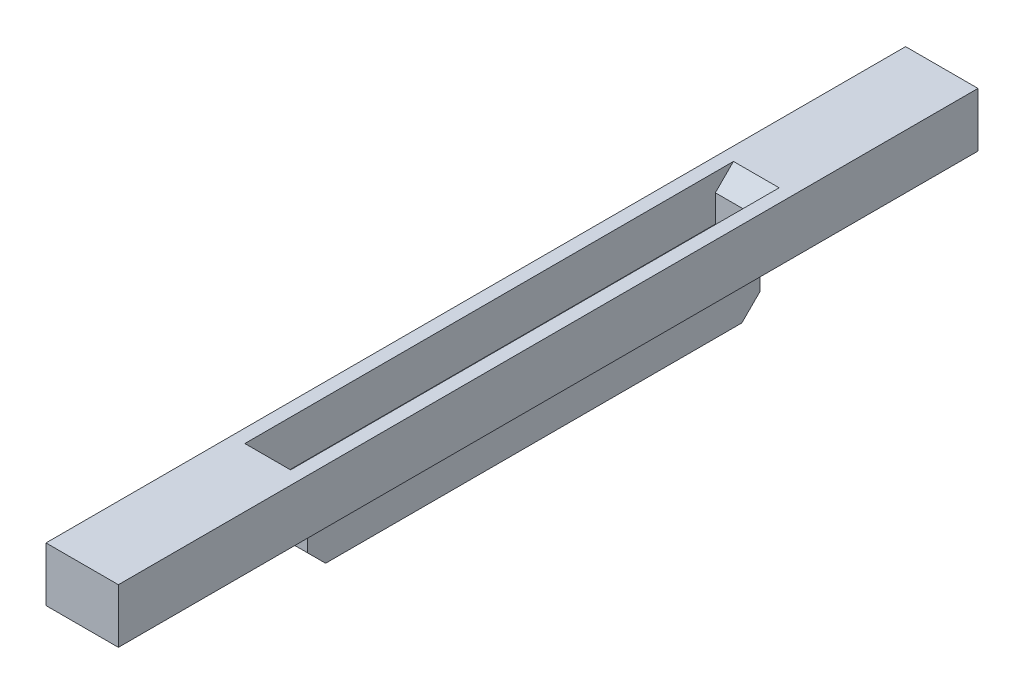
ISO-10303-21;
HEADER;
FILE_DESCRIPTION(('STEP AP214'),'2;1');
FILE_NAME('part.step','',(''),(''),'','','');
FILE_SCHEMA(('AUTOMOTIVE_DESIGN { 1 0 10303 214 1 1 1 1 }'));
ENDSEC;
DATA;
#1=APPLICATION_CONTEXT('core data for automotive mechanical design processes');
#2=APPLICATION_PROTOCOL_DEFINITION('international standard','automotive_design',2000,#1);
#3=PRODUCT_CONTEXT('',#1,'mechanical');
#4=PRODUCT('Part','Part','',(#3));
#5=PRODUCT_RELATED_PRODUCT_CATEGORY('part','',(#4));
#6=PRODUCT_DEFINITION_FORMATION('','',#4);
#7=PRODUCT_DEFINITION_CONTEXT('part definition',#1,'design');
#8=PRODUCT_DEFINITION('design','',#6,#7);
#9=PRODUCT_DEFINITION_SHAPE('','',#8);
#10=(LENGTH_UNIT() NAMED_UNIT(*) SI_UNIT(.MILLI.,.METRE.));
#11=(NAMED_UNIT(*) PLANE_ANGLE_UNIT() SI_UNIT($,.RADIAN.));
#12=(NAMED_UNIT(*) SI_UNIT($,.STERADIAN.) SOLID_ANGLE_UNIT());
#13=UNCERTAINTY_MEASURE_WITH_UNIT(LENGTH_MEASURE(1.E-05),#10,'distance_accuracy_value','');
#14=(GEOMETRIC_REPRESENTATION_CONTEXT(3) GLOBAL_UNCERTAINTY_ASSIGNED_CONTEXT((#13)) GLOBAL_UNIT_ASSIGNED_CONTEXT((#10,
#11,#12)) REPRESENTATION_CONTEXT('',''));
#15=CARTESIAN_POINT('',(0.,0.,0.));
#16=DIRECTION('',(0.,0.,1.));
#17=DIRECTION('',(1.,0.,0.));
#18=AXIS2_PLACEMENT_3D('',#15,#16,#17);
#19=CARTESIAN_POINT('',(0.,-1.,0.));
#20=DIRECTION('',(0.,1.,0.));
#21=DIRECTION('',(0.,0.,1.));
#22=AXIS2_PLACEMENT_3D('',#19,#20,#21);
#23=PLANE('',#22);
#24=DIRECTION('',(0.,0.,1.));
#25=VECTOR('',#24,1.);
#26=CARTESIAN_POINT('',(4.,-1.,0.));
#27=LINE('',#26,#25);
#28=CARTESIAN_POINT('',(4.,-1.,-47.5));
#29=VERTEX_POINT('',#28);
#30=CARTESIAN_POINT('',(4.00000000000001,-1.,47.5));
#31=VERTEX_POINT('',#30);
#32=EDGE_CURVE('E186',#29,#31,#27,.T.);
#33=ORIENTED_EDGE('',*,*,#32,.T.);
#34=DIRECTION('',(1.,0.,0.));
#35=VECTOR('',#34,1.);
#36=CARTESIAN_POINT('',(0.,-1.,47.5));
#37=LINE('',#36,#35);
#38=CARTESIAN_POINT('',(-3.99999999999999,-1.,47.5));
#39=VERTEX_POINT('',#38);
#40=EDGE_CURVE('E195',#39,#31,#37,.T.);
#41=ORIENTED_EDGE('',*,*,#40,.F.);
#42=DIRECTION('',(0.,0.,1.));
#43=VECTOR('',#42,1.);
#44=CARTESIAN_POINT('',(-4.,-1.,0.));
#45=LINE('',#44,#43);
#46=CARTESIAN_POINT('',(-4.,-1.,-47.5));
#47=VERTEX_POINT('',#46);
#48=EDGE_CURVE('E192',#47,#39,#45,.T.);
#49=ORIENTED_EDGE('',*,*,#48,.F.);
#50=DIRECTION('',(1.,0.,0.));
#51=VECTOR('',#50,1.);
#52=CARTESIAN_POINT('',(0.,-1.,-47.5));
#53=LINE('',#52,#51);
#54=EDGE_CURVE('E189',#47,#29,#53,.T.);
#55=ORIENTED_EDGE('',*,*,#54,.T.);
#56=EDGE_LOOP('',(#33,#41,#49,#55));
#57=FACE_BOUND('',#56,.T.);
#58=DIRECTION('',(0.,0.,-1.));
#59=VECTOR('',#58,1.);
#60=CARTESIAN_POINT('',(-2.4,-1.,25.));
#61=LINE('',#60,#59);
#62=CARTESIAN_POINT('',(-2.4,-1.,25.));
#63=VERTEX_POINT('',#62);
#64=CARTESIAN_POINT('',(-2.4,-1.,-25.));
#65=VERTEX_POINT('',#64);
#66=EDGE_CURVE('E153',#63,#65,#61,.T.);
#67=ORIENTED_EDGE('',*,*,#66,.F.);
#68=DIRECTION('',(-1.,0.,0.));
#69=VECTOR('',#68,1.);
#70=CARTESIAN_POINT('',(2.4,-1.,25.));
#71=LINE('',#70,#69);
#72=CARTESIAN_POINT('',(2.4,-1.,25.));
#73=VERTEX_POINT('',#72);
#74=EDGE_CURVE('E166',#73,#63,#71,.T.);
#75=ORIENTED_EDGE('',*,*,#74,.F.);
#76=DIRECTION('',(0.,0.,1.));
#77=VECTOR('',#76,1.);
#78=CARTESIAN_POINT('',(2.4,-1.,25.));
#79=LINE('',#78,#77);
#80=CARTESIAN_POINT('',(2.4,-1.,-25.));
#81=VERTEX_POINT('',#80);
#82=EDGE_CURVE('E174',#81,#73,#79,.T.);
#83=ORIENTED_EDGE('',*,*,#82,.F.);
#84=DIRECTION('',(1.,0.,0.));
#85=VECTOR('',#84,1.);
#86=CARTESIAN_POINT('',(2.4,-1.,-25.));
#87=LINE('',#86,#85);
#88=EDGE_CURVE('E169',#65,#81,#87,.T.);
#89=ORIENTED_EDGE('',*,*,#88,.F.);
#90=EDGE_LOOP('',(#67,#75,#83,#89));
#91=FACE_BOUND('',#90,.T.);
#92=ADVANCED_FACE('F37',(#57,#91),#23,.F.);
#93=CARTESIAN_POINT('',(0.,5.,0.));
#94=DIRECTION('',(0.,1.,0.));
#95=DIRECTION('',(0.,0.,1.));
#96=AXIS2_PLACEMENT_3D('',#93,#94,#95);
#97=PLANE('',#96);
#98=DIRECTION('',(0.,0.,-1.));
#99=VECTOR('',#98,1.);
#100=CARTESIAN_POINT('',(4.,5.,-47.5));
#101=LINE('',#100,#99);
#102=CARTESIAN_POINT('',(4.00000000000001,5.,47.5));
#103=VERTEX_POINT('',#102);
#104=CARTESIAN_POINT('',(4.,5.,-47.5));
#105=VERTEX_POINT('',#104);
#106=EDGE_CURVE('E222',#103,#105,#101,.T.);
#107=ORIENTED_EDGE('',*,*,#106,.T.);
#108=DIRECTION('',(-1.,0.,0.));
#109=VECTOR('',#108,1.);
#110=CARTESIAN_POINT('',(-4.,5.,-47.5));
#111=LINE('',#110,#109);
#112=CARTESIAN_POINT('',(-4.,5.,-47.5));
#113=VERTEX_POINT('',#112);
#114=EDGE_CURVE('E225',#105,#113,#111,.T.);
#115=ORIENTED_EDGE('',*,*,#114,.T.);
#116=DIRECTION('',(0.,0.,1.));
#117=VECTOR('',#116,1.);
#118=CARTESIAN_POINT('',(-4.,5.,-47.5));
#119=LINE('',#118,#117);
#120=CARTESIAN_POINT('',(-3.99999999999999,5.,47.5));
#121=VERTEX_POINT('',#120);
#122=EDGE_CURVE('E227',#113,#121,#119,.T.);
#123=ORIENTED_EDGE('',*,*,#122,.T.);
#124=DIRECTION('',(1.,0.,0.));
#125=VECTOR('',#124,1.);
#126=CARTESIAN_POINT('',(-3.99999999999999,5.,47.5));
#127=LINE('',#126,#125);
#128=EDGE_CURVE('E229',#121,#103,#127,.T.);
#129=ORIENTED_EDGE('',*,*,#128,.T.);
#130=EDGE_LOOP('',(#107,#115,#123,#129));
#131=FACE_BOUND('',#130,.T.);
#132=DIRECTION('',(0.,0.,1.));
#133=VECTOR('',#132,1.);
#134=CARTESIAN_POINT('',(-2.525,5.,-25.));
#135=LINE('',#134,#133);
#136=CARTESIAN_POINT('',(-2.525,5.,-27.));
#137=VERTEX_POINT('',#136);
#138=CARTESIAN_POINT('',(-2.525,5.,27.));
#139=VERTEX_POINT('',#138);
#140=EDGE_CURVE('E201',#137,#139,#135,.T.);
#141=ORIENTED_EDGE('',*,*,#140,.F.);
#142=DIRECTION('',(1.,0.,0.));
#143=VECTOR('',#142,1.);
#144=CARTESIAN_POINT('',(0.,5.,-27.));
#145=LINE('',#144,#143);
#146=CARTESIAN_POINT('',(2.525,5.,-27.));
#147=VERTEX_POINT('',#146);
#148=EDGE_CURVE('E262',#137,#147,#145,.T.);
#149=ORIENTED_EDGE('',*,*,#148,.T.);
#150=DIRECTION('',(0.,0.,-1.));
#151=VECTOR('',#150,1.);
#152=CARTESIAN_POINT('',(2.525,5.,-25.));
#153=LINE('',#152,#151);
#154=CARTESIAN_POINT('',(2.525,5.,27.));
#155=VERTEX_POINT('',#154);
#156=EDGE_CURVE('E199',#155,#147,#153,.T.);
#157=ORIENTED_EDGE('',*,*,#156,.F.);
#158=DIRECTION('',(-1.,0.,0.));
#159=VECTOR('',#158,1.);
#160=CARTESIAN_POINT('',(0.,5.,27.));
#161=LINE('',#160,#159);
#162=EDGE_CURVE('E259',#155,#139,#161,.T.);
#163=ORIENTED_EDGE('',*,*,#162,.T.);
#164=EDGE_LOOP('',(#141,#149,#157,#163));
#165=FACE_BOUND('',#164,.T.);
#166=ADVANCED_FACE('F276',(#131,#165),#97,.T.);
#167=CARTESIAN_POINT('',(4.,5.,-47.5));
#168=DIRECTION('',(-1.,0.,0.));
#169=DIRECTION('',(0.,0.,1.));
#170=AXIS2_PLACEMENT_3D('',#167,#168,#169);
#171=PLANE('',#170);
#172=DIRECTION('',(0.,-1.,0.));
#173=VECTOR('',#172,1.);
#174=CARTESIAN_POINT('',(4.00000000000001,5.,47.5));
#175=LINE('',#174,#173);
#176=EDGE_CURVE('E231',#103,#31,#175,.T.);
#177=ORIENTED_EDGE('',*,*,#176,.T.);
#178=ORIENTED_EDGE('',*,*,#32,.F.);
#179=DIRECTION('',(0.,-1.,0.));
#180=VECTOR('',#179,1.);
#181=CARTESIAN_POINT('',(4.,5.,-47.5));
#182=LINE('',#181,#180);
#183=EDGE_CURVE('E237',#105,#29,#182,.T.);
#184=ORIENTED_EDGE('',*,*,#183,.F.);
#185=ORIENTED_EDGE('',*,*,#106,.F.);
#186=EDGE_LOOP('',(#177,#178,#184,#185));
#187=FACE_BOUND('',#186,.T.);
#188=ADVANCED_FACE('F308',(#187),#171,.F.);
#189=CARTESIAN_POINT('',(-4.,5.,-47.5));
#190=DIRECTION('',(0.,0.,1.));
#191=DIRECTION('',(1.,0.,0.));
#192=AXIS2_PLACEMENT_3D('',#189,#190,#191);
#193=PLANE('',#192);
#194=ORIENTED_EDGE('',*,*,#183,.T.);
#195=ORIENTED_EDGE('',*,*,#54,.F.);
#196=DIRECTION('',(0.,-1.,0.));
#197=VECTOR('',#196,1.);
#198=CARTESIAN_POINT('',(-4.,5.,-47.5));
#199=LINE('',#198,#197);
#200=EDGE_CURVE('E235',#113,#47,#199,.T.);
#201=ORIENTED_EDGE('',*,*,#200,.F.);
#202=ORIENTED_EDGE('',*,*,#114,.F.);
#203=EDGE_LOOP('',(#194,#195,#201,#202));
#204=FACE_BOUND('',#203,.T.);
#205=ADVANCED_FACE('F360',(#204),#193,.F.);
#206=CARTESIAN_POINT('',(-4.,5.,-47.5));
#207=DIRECTION('',(1.,0.,0.));
#208=DIRECTION('',(0.,0.,-1.));
#209=AXIS2_PLACEMENT_3D('',#206,#207,#208);
#210=PLANE('',#209);
#211=ORIENTED_EDGE('',*,*,#200,.T.);
#212=ORIENTED_EDGE('',*,*,#48,.T.);
#213=DIRECTION('',(0.,-1.,0.));
#214=VECTOR('',#213,1.);
#215=CARTESIAN_POINT('',(-3.99999999999999,5.,47.5));
#216=LINE('',#215,#214);
#217=EDGE_CURVE('E233',#121,#39,#216,.T.);
#218=ORIENTED_EDGE('',*,*,#217,.F.);
#219=ORIENTED_EDGE('',*,*,#122,.F.);
#220=EDGE_LOOP('',(#211,#212,#218,#219));
#221=FACE_BOUND('',#220,.T.);
#222=ADVANCED_FACE('F364',(#221),#210,.F.);
#223=CARTESIAN_POINT('',(-3.99999999999999,5.,47.5));
#224=DIRECTION('',(0.,0.,-1.));
#225=DIRECTION('',(-1.,0.,0.));
#226=AXIS2_PLACEMENT_3D('',#223,#224,#225);
#227=PLANE('',#226);
#228=ORIENTED_EDGE('',*,*,#217,.T.);
#229=ORIENTED_EDGE('',*,*,#40,.T.);
#230=ORIENTED_EDGE('',*,*,#176,.F.);
#231=ORIENTED_EDGE('',*,*,#128,.F.);
#232=EDGE_LOOP('',(#228,#229,#230,#231));
#233=FACE_BOUND('',#232,.T.);
#234=ADVANCED_FACE('F368',(#233),#227,.F.);
#235=CARTESIAN_POINT('',(2.525,5.,-25.));
#236=DIRECTION('',(-1.,0.,0.));
#237=DIRECTION('',(0.,0.,1.));
#238=AXIS2_PLACEMENT_3D('',#235,#236,#237);
#239=PLANE('',#238);
#240=DIRECTION('',(0.,0.,-1.));
#241=VECTOR('',#240,1.);
#242=CARTESIAN_POINT('',(2.525,0.,-25.));
#243=LINE('',#242,#241);
#244=CARTESIAN_POINT('',(2.52500000000001,0.,25.));
#245=VERTEX_POINT('',#244);
#246=CARTESIAN_POINT('',(2.525,0.,-25.));
#247=VERTEX_POINT('',#246);
#248=EDGE_CURVE('E198',#245,#247,#243,.T.);
#249=ORIENTED_EDGE('',*,*,#248,.F.);
#250=DIRECTION('',(0.,-1.,0.));
#251=VECTOR('',#250,1.);
#252=CARTESIAN_POINT('',(2.525,5.,25.));
#253=LINE('',#252,#251);
#254=CARTESIAN_POINT('',(2.525,2.99999999999997,25.));
#255=VERTEX_POINT('',#254);
#256=EDGE_CURVE('E204',#255,#245,#253,.T.);
#257=ORIENTED_EDGE('',*,*,#256,.F.);
#258=DIRECTION('',(0.,-0.707106781186548,-0.707106781186548));
#259=VECTOR('',#258,1.);
#260=CARTESIAN_POINT('',(2.525,2.99999999999997,25.));
#261=LINE('',#260,#259);
#262=EDGE_CURVE('E45',#255,#155,#261,.F.);
#263=ORIENTED_EDGE('',*,*,#262,.T.);
#264=ORIENTED_EDGE('',*,*,#156,.T.);
#265=DIRECTION('',(0.,0.707106781186548,-0.707106781186548));
#266=VECTOR('',#265,1.);
#267=CARTESIAN_POINT('',(2.525,2.99999999999997,-25.));
#268=LINE('',#267,#266);
#269=CARTESIAN_POINT('',(2.525,2.99999999999997,-25.));
#270=VERTEX_POINT('',#269);
#271=EDGE_CURVE('E270',#147,#270,#268,.F.);
#272=ORIENTED_EDGE('',*,*,#271,.T.);
#273=DIRECTION('',(0.,-1.,0.));
#274=VECTOR('',#273,1.);
#275=CARTESIAN_POINT('',(2.525,5.,-25.));
#276=LINE('',#275,#274);
#277=EDGE_CURVE('E220',#270,#247,#276,.T.);
#278=ORIENTED_EDGE('',*,*,#277,.T.);
#279=EDGE_LOOP('',(#249,#257,#263,#264,#272,#278));
#280=FACE_BOUND('',#279,.T.);
#281=ADVANCED_FACE('F274',(#280),#239,.T.);
#282=CARTESIAN_POINT('',(-2.525,5.,-25.));
#283=DIRECTION('',(0.,0.,1.));
#284=DIRECTION('',(1.,0.,0.));
#285=AXIS2_PLACEMENT_3D('',#282,#283,#284);
#286=PLANE('',#285);
#287=ORIENTED_EDGE('',*,*,#277,.F.);
#288=DIRECTION('',(-1.,0.,0.));
#289=VECTOR('',#288,1.);
#290=CARTESIAN_POINT('',(-2.525,2.99999999999997,-25.));
#291=LINE('',#290,#289);
#292=CARTESIAN_POINT('',(-2.525,2.99999999999997,-25.));
#293=VERTEX_POINT('',#292);
#294=EDGE_CURVE('E256',#270,#293,#291,.T.);
#295=ORIENTED_EDGE('',*,*,#294,.T.);
#296=DIRECTION('',(0.,-1.,0.));
#297=VECTOR('',#296,1.);
#298=CARTESIAN_POINT('',(-2.525,5.,-25.));
#299=LINE('',#298,#297);
#300=CARTESIAN_POINT('',(-2.525,0.,-25.));
#301=VERTEX_POINT('',#300);
#302=EDGE_CURVE('E218',#293,#301,#299,.T.);
#303=ORIENTED_EDGE('',*,*,#302,.T.);
#304=DIRECTION('',(-1.,0.,0.));
#305=VECTOR('',#304,1.);
#306=CARTESIAN_POINT('',(-2.525,0.,-25.));
#307=LINE('',#306,#305);
#308=EDGE_CURVE('E207',#247,#301,#307,.T.);
#309=ORIENTED_EDGE('',*,*,#308,.F.);
#310=EDGE_LOOP('',(#287,#295,#303,#309));
#311=FACE_BOUND('',#310,.T.);
#312=ADVANCED_FACE('F285',(#311),#286,.T.);
#313=CARTESIAN_POINT('',(-2.525,5.,-25.));
#314=DIRECTION('',(1.,0.,0.));
#315=DIRECTION('',(0.,0.,-1.));
#316=AXIS2_PLACEMENT_3D('',#313,#314,#315);
#317=PLANE('',#316);
#318=DIRECTION('',(0.,0.,1.));
#319=VECTOR('',#318,1.);
#320=CARTESIAN_POINT('',(-2.525,0.,-25.));
#321=LINE('',#320,#319);
#322=CARTESIAN_POINT('',(-2.525,0.,25.));
#323=VERTEX_POINT('',#322);
#324=EDGE_CURVE('E210',#301,#323,#321,.T.);
#325=ORIENTED_EDGE('',*,*,#324,.F.);
#326=ORIENTED_EDGE('',*,*,#302,.F.);
#327=DIRECTION('',(0.,-0.707106781186548,0.707106781186548));
#328=VECTOR('',#327,1.);
#329=CARTESIAN_POINT('',(-2.525,2.99999999999997,-25.));
#330=LINE('',#329,#328);
#331=EDGE_CURVE('E267',#293,#137,#330,.F.);
#332=ORIENTED_EDGE('',*,*,#331,.T.);
#333=ORIENTED_EDGE('',*,*,#140,.T.);
#334=DIRECTION('',(0.,0.707106781186548,0.707106781186548));
#335=VECTOR('',#334,1.);
#336=CARTESIAN_POINT('',(-2.525,2.99999999999997,25.));
#337=LINE('',#336,#335);
#338=CARTESIAN_POINT('',(-2.525,2.99999999999997,25.));
#339=VERTEX_POINT('',#338);
#340=EDGE_CURVE('E11',#139,#339,#337,.F.);
#341=ORIENTED_EDGE('',*,*,#340,.T.);
#342=DIRECTION('',(0.,-1.,0.));
#343=VECTOR('',#342,1.);
#344=CARTESIAN_POINT('',(-2.525,5.,25.));
#345=LINE('',#344,#343);
#346=EDGE_CURVE('E216',#339,#323,#345,.T.);
#347=ORIENTED_EDGE('',*,*,#346,.T.);
#348=EDGE_LOOP('',(#325,#326,#332,#333,#341,#347));
#349=FACE_BOUND('',#348,.T.);
#350=ADVANCED_FACE('F293',(#349),#317,.T.);
#351=CARTESIAN_POINT('',(-2.525,5.,25.));
#352=DIRECTION('',(0.,0.,-1.));
#353=DIRECTION('',(-1.,0.,0.));
#354=AXIS2_PLACEMENT_3D('',#351,#352,#353);
#355=PLANE('',#354);
#356=ORIENTED_EDGE('',*,*,#346,.F.);
#357=DIRECTION('',(1.,0.,0.));
#358=VECTOR('',#357,1.);
#359=CARTESIAN_POINT('',(-2.525,2.99999999999997,25.));
#360=LINE('',#359,#358);
#361=EDGE_CURVE('E265',#339,#255,#360,.T.);
#362=ORIENTED_EDGE('',*,*,#361,.T.);
#363=ORIENTED_EDGE('',*,*,#256,.T.);
#364=DIRECTION('',(1.,0.,0.));
#365=VECTOR('',#364,1.);
#366=CARTESIAN_POINT('',(-2.525,0.,25.));
#367=LINE('',#366,#365);
#368=EDGE_CURVE('E202',#323,#245,#367,.T.);
#369=ORIENTED_EDGE('',*,*,#368,.F.);
#370=EDGE_LOOP('',(#356,#362,#363,#369));
#371=FACE_BOUND('',#370,.T.);
#372=ADVANCED_FACE('F292',(#371),#355,.T.);
#373=CARTESIAN_POINT('',(0.,0.,0.));
#374=DIRECTION('',(0.,1.,0.));
#375=DIRECTION('',(0.,0.,1.));
#376=AXIS2_PLACEMENT_3D('',#373,#374,#375);
#377=PLANE('',#376);
#378=ORIENTED_EDGE('',*,*,#368,.T.);
#379=ORIENTED_EDGE('',*,*,#248,.T.);
#380=ORIENTED_EDGE('',*,*,#308,.T.);
#381=ORIENTED_EDGE('',*,*,#324,.T.);
#382=EDGE_LOOP('',(#378,#379,#380,#381));
#383=FACE_BOUND('',#382,.T.);
#384=ADVANCED_FACE('F289',(#383),#377,.T.);
#385=CARTESIAN_POINT('',(-2.4,-6.,25.));
#386=DIRECTION('',(1.,0.,0.));
#387=DIRECTION('',(0.,0.,-1.));
#388=AXIS2_PLACEMENT_3D('',#385,#386,#387);
#389=PLANE('',#388);
#390=DIRECTION('',(0.,1.,0.));
#391=VECTOR('',#390,1.);
#392=CARTESIAN_POINT('',(-2.4,-6.,-25.));
#393=LINE('',#392,#391);
#394=CARTESIAN_POINT('',(-2.4,-4.,-25.));
#395=VERTEX_POINT('',#394);
#396=EDGE_CURVE('E184',#395,#65,#393,.T.);
#397=ORIENTED_EDGE('',*,*,#396,.F.);
#398=DIRECTION('',(0.,0.707106781186548,-0.707106781186548));
#399=VECTOR('',#398,1.);
#400=CARTESIAN_POINT('',(-2.4,-6.,-23.));
#401=LINE('',#400,#399);
#402=CARTESIAN_POINT('',(-2.4,-6.00000000000001,-23.));
#403=VERTEX_POINT('',#402);
#404=EDGE_CURVE('E252',#395,#403,#401,.F.);
#405=ORIENTED_EDGE('',*,*,#404,.T.);
#406=DIRECTION('',(0.,0.,-1.));
#407=VECTOR('',#406,1.);
#408=CARTESIAN_POINT('',(-2.4,-6.,25.));
#409=LINE('',#408,#407);
#410=CARTESIAN_POINT('',(-2.4,-6.,23.));
#411=VERTEX_POINT('',#410);
#412=EDGE_CURVE('E173',#411,#403,#409,.T.);
#413=ORIENTED_EDGE('',*,*,#412,.F.);
#414=DIRECTION('',(0.,-0.707106781186548,-0.707106781186548));
#415=VECTOR('',#414,1.);
#416=CARTESIAN_POINT('',(-2.4,-6.,23.));
#417=LINE('',#416,#415);
#418=CARTESIAN_POINT('',(-2.4,-4.,25.));
#419=VERTEX_POINT('',#418);
#420=EDGE_CURVE('E155',#411,#419,#417,.F.);
#421=ORIENTED_EDGE('',*,*,#420,.T.);
#422=DIRECTION('',(0.,1.,0.));
#423=VECTOR('',#422,1.);
#424=CARTESIAN_POINT('',(-2.4,-6.,25.));
#425=LINE('',#424,#423);
#426=EDGE_CURVE('E149',#419,#63,#425,.T.);
#427=ORIENTED_EDGE('',*,*,#426,.T.);
#428=ORIENTED_EDGE('',*,*,#66,.T.);
#429=EDGE_LOOP('',(#397,#405,#413,#421,#427,#428));
#430=FACE_BOUND('',#429,.T.);
#431=ADVANCED_FACE('F152',(#430),#389,.F.);
#432=CARTESIAN_POINT('',(2.4,-6.,-25.));
#433=DIRECTION('',(0.,0.,1.));
#434=DIRECTION('',(1.,0.,0.));
#435=AXIS2_PLACEMENT_3D('',#432,#433,#434);
#436=PLANE('',#435);
#437=DIRECTION('',(0.,1.,0.));
#438=VECTOR('',#437,1.);
#439=CARTESIAN_POINT('',(2.4,-6.,-25.));
#440=LINE('',#439,#438);
#441=CARTESIAN_POINT('',(2.4,-4.,-25.));
#442=VERTEX_POINT('',#441);
#443=EDGE_CURVE('E182',#442,#81,#440,.T.);
#444=ORIENTED_EDGE('',*,*,#443,.F.);
#445=DIRECTION('',(-1.,0.,0.));
#446=VECTOR('',#445,1.);
#447=CARTESIAN_POINT('',(2.4,-4.,-25.));
#448=LINE('',#447,#446);
#449=EDGE_CURVE('E249',#442,#395,#448,.T.);
#450=ORIENTED_EDGE('',*,*,#449,.T.);
#451=ORIENTED_EDGE('',*,*,#396,.T.);
#452=ORIENTED_EDGE('',*,*,#88,.T.);
#453=EDGE_LOOP('',(#444,#450,#451,#452));
#454=FACE_BOUND('',#453,.T.);
#455=ADVANCED_FACE('F318',(#454),#436,.F.);
#456=CARTESIAN_POINT('',(2.4,-6.,25.));
#457=DIRECTION('',(-1.,0.,0.));
#458=DIRECTION('',(0.,0.,1.));
#459=AXIS2_PLACEMENT_3D('',#456,#457,#458);
#460=PLANE('',#459);
#461=DIRECTION('',(0.,0.,1.));
#462=VECTOR('',#461,1.);
#463=CARTESIAN_POINT('',(2.4,-6.,25.));
#464=LINE('',#463,#462);
#465=CARTESIAN_POINT('',(2.4,-6.00000000000001,-23.));
#466=VERTEX_POINT('',#465);
#467=CARTESIAN_POINT('',(2.4,-6.,23.));
#468=VERTEX_POINT('',#467);
#469=EDGE_CURVE('E160',#466,#468,#464,.T.);
#470=ORIENTED_EDGE('',*,*,#469,.F.);
#471=DIRECTION('',(0.,-0.707106781186548,0.707106781186548));
#472=VECTOR('',#471,1.);
#473=CARTESIAN_POINT('',(2.4,-6.,-23.));
#474=LINE('',#473,#472);
#475=EDGE_CURVE('E247',#466,#442,#474,.F.);
#476=ORIENTED_EDGE('',*,*,#475,.T.);
#477=ORIENTED_EDGE('',*,*,#443,.T.);
#478=ORIENTED_EDGE('',*,*,#82,.T.);
#479=DIRECTION('',(0.,1.,0.));
#480=VECTOR('',#479,1.);
#481=CARTESIAN_POINT('',(2.4,-6.,25.));
#482=LINE('',#481,#480);
#483=CARTESIAN_POINT('',(2.4,-4.,25.));
#484=VERTEX_POINT('',#483);
#485=EDGE_CURVE('E159',#484,#73,#482,.T.);
#486=ORIENTED_EDGE('',*,*,#485,.F.);
#487=DIRECTION('',(0.,0.707106781186548,0.707106781186548));
#488=VECTOR('',#487,1.);
#489=CARTESIAN_POINT('',(2.4,-6.,23.));
#490=LINE('',#489,#488);
#491=EDGE_CURVE('E245',#484,#468,#490,.F.);
#492=ORIENTED_EDGE('',*,*,#491,.T.);
#493=EDGE_LOOP('',(#470,#476,#477,#478,#486,#492));
#494=FACE_BOUND('',#493,.T.);
#495=ADVANCED_FACE('F322',(#494),#460,.F.);
#496=CARTESIAN_POINT('',(2.4,-6.,25.));
#497=DIRECTION('',(0.,0.,-1.));
#498=DIRECTION('',(-1.,0.,0.));
#499=AXIS2_PLACEMENT_3D('',#496,#497,#498);
#500=PLANE('',#499);
#501=ORIENTED_EDGE('',*,*,#426,.F.);
#502=DIRECTION('',(1.,0.,0.));
#503=VECTOR('',#502,1.);
#504=CARTESIAN_POINT('',(2.4,-4.,25.));
#505=LINE('',#504,#503);
#506=EDGE_CURVE('E254',#419,#484,#505,.T.);
#507=ORIENTED_EDGE('',*,*,#506,.T.);
#508=ORIENTED_EDGE('',*,*,#485,.T.);
#509=ORIENTED_EDGE('',*,*,#74,.T.);
#510=EDGE_LOOP('',(#501,#507,#508,#509));
#511=FACE_BOUND('',#510,.T.);
#512=ADVANCED_FACE('F171',(#511),#500,.F.);
#513=CARTESIAN_POINT('',(0.,-6.,0.));
#514=DIRECTION('',(0.,1.,0.));
#515=DIRECTION('',(0.,0.,1.));
#516=AXIS2_PLACEMENT_3D('',#513,#514,#515);
#517=PLANE('',#516);
#518=ORIENTED_EDGE('',*,*,#412,.T.);
#519=DIRECTION('',(1.,0.,0.));
#520=VECTOR('',#519,1.);
#521=CARTESIAN_POINT('',(0.,-6.,-23.));
#522=LINE('',#521,#520);
#523=EDGE_CURVE('E242',#403,#466,#522,.T.);
#524=ORIENTED_EDGE('',*,*,#523,.T.);
#525=ORIENTED_EDGE('',*,*,#469,.T.);
#526=DIRECTION('',(-1.,0.,0.));
#527=VECTOR('',#526,1.);
#528=CARTESIAN_POINT('',(0.,-6.,23.));
#529=LINE('',#528,#527);
#530=EDGE_CURVE('E239',#468,#411,#529,.T.);
#531=ORIENTED_EDGE('',*,*,#530,.T.);
#532=EDGE_LOOP('',(#518,#524,#525,#531));
#533=FACE_BOUND('',#532,.T.);
#534=ADVANCED_FACE('F333',(#533),#517,.F.);
#535=CARTESIAN_POINT('',(0.,-6.,-23.));
#536=DIRECTION('',(0.,0.707106781186547,0.707106781186547));
#537=DIRECTION('',(1.,0.,0.));
#538=AXIS2_PLACEMENT_3D('',#535,#536,#537);
#539=PLANE('',#538);
#540=ORIENTED_EDGE('',*,*,#404,.F.);
#541=ORIENTED_EDGE('',*,*,#449,.F.);
#542=ORIENTED_EDGE('',*,*,#475,.F.);
#543=ORIENTED_EDGE('',*,*,#523,.F.);
#544=EDGE_LOOP('',(#540,#541,#542,#543));
#545=FACE_BOUND('',#544,.T.);
#546=ADVANCED_FACE('F335',(#545),#539,.F.);
#547=CARTESIAN_POINT('',(0.,-6.,23.));
#548=DIRECTION('',(0.,0.707106781186547,-0.707106781186547));
#549=DIRECTION('',(-1.,0.,0.));
#550=AXIS2_PLACEMENT_3D('',#547,#548,#549);
#551=PLANE('',#550);
#552=ORIENTED_EDGE('',*,*,#491,.F.);
#553=ORIENTED_EDGE('',*,*,#506,.F.);
#554=ORIENTED_EDGE('',*,*,#420,.F.);
#555=ORIENTED_EDGE('',*,*,#530,.F.);
#556=EDGE_LOOP('',(#552,#553,#554,#555));
#557=FACE_BOUND('',#556,.T.);
#558=ADVANCED_FACE('F340',(#557),#551,.F.);
#559=CARTESIAN_POINT('',(-2.525,2.99999999999997,-25.));
#560=DIRECTION('',(0.,-0.707106781186547,-0.707106781186547));
#561=DIRECTION('',(-1.,0.,0.));
#562=AXIS2_PLACEMENT_3D('',#559,#560,#561);
#563=PLANE('',#562);
#564=ORIENTED_EDGE('',*,*,#271,.F.);
#565=ORIENTED_EDGE('',*,*,#148,.F.);
#566=ORIENTED_EDGE('',*,*,#331,.F.);
#567=ORIENTED_EDGE('',*,*,#294,.F.);
#568=EDGE_LOOP('',(#564,#565,#566,#567));
#569=FACE_BOUND('',#568,.T.);
#570=ADVANCED_FACE('F281',(#569),#563,.F.);
#571=CARTESIAN_POINT('',(-2.525,2.99999999999997,25.));
#572=DIRECTION('',(0.,-0.707106781186547,0.707106781186547));
#573=DIRECTION('',(1.,0.,0.));
#574=AXIS2_PLACEMENT_3D('',#571,#572,#573);
#575=PLANE('',#574);
#576=ORIENTED_EDGE('',*,*,#340,.F.);
#577=ORIENTED_EDGE('',*,*,#162,.F.);
#578=ORIENTED_EDGE('',*,*,#262,.F.);
#579=ORIENTED_EDGE('',*,*,#361,.F.);
#580=EDGE_LOOP('',(#576,#577,#578,#579));
#581=FACE_BOUND('',#580,.T.);
#582=ADVANCED_FACE('F39',(#581),#575,.F.);
#583=CLOSED_SHELL('',(#92,#166,#188,#205,#222,#234,#281,#312,#350,#372,#384,#431,#455,#495,#512,
#534,#546,#558,#570,#582));
#584=MANIFOLD_SOLID_BREP('B2',#583);
#585=ADVANCED_BREP_SHAPE_REPRESENTATION('',(#18,#584),#14);
#586=SHAPE_DEFINITION_REPRESENTATION(#9,#585);
ENDSEC;
END-ISO-10303-21;
